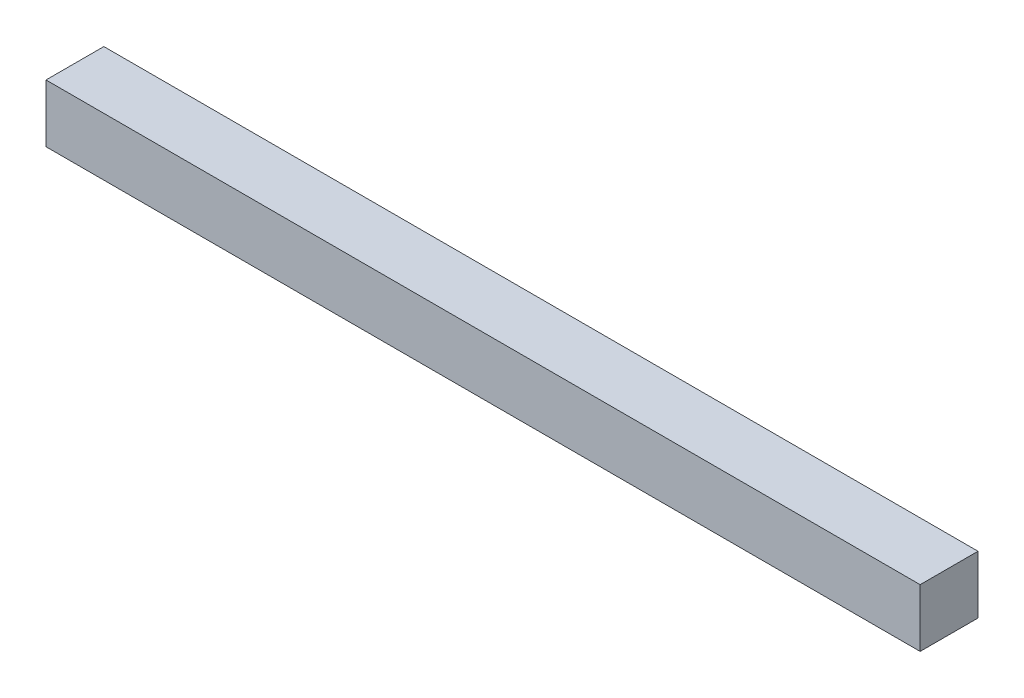
ISO-10303-21;
HEADER;
FILE_DESCRIPTION(('STEP AP214'),'2;1');
FILE_NAME('part.step','',(''),(''),'','','');
FILE_SCHEMA(('AUTOMOTIVE_DESIGN { 1 0 10303 214 1 1 1 1 }'));
ENDSEC;
DATA;
#1=APPLICATION_CONTEXT('core data for automotive mechanical design processes');
#2=APPLICATION_PROTOCOL_DEFINITION('international standard','automotive_design',2000,#1);
#3=PRODUCT_CONTEXT('',#1,'mechanical');
#4=PRODUCT('Part','Part','',(#3));
#5=PRODUCT_RELATED_PRODUCT_CATEGORY('part','',(#4));
#6=PRODUCT_DEFINITION_FORMATION('','',#4);
#7=PRODUCT_DEFINITION_CONTEXT('part definition',#1,'design');
#8=PRODUCT_DEFINITION('design','',#6,#7);
#9=PRODUCT_DEFINITION_SHAPE('','',#8);
#10=(LENGTH_UNIT() NAMED_UNIT(*) SI_UNIT(.MILLI.,.METRE.));
#11=(NAMED_UNIT(*) PLANE_ANGLE_UNIT() SI_UNIT($,.RADIAN.));
#12=(NAMED_UNIT(*) SI_UNIT($,.STERADIAN.) SOLID_ANGLE_UNIT());
#13=UNCERTAINTY_MEASURE_WITH_UNIT(LENGTH_MEASURE(1.E-05),#10,'distance_accuracy_value','');
#14=(GEOMETRIC_REPRESENTATION_CONTEXT(3) GLOBAL_UNCERTAINTY_ASSIGNED_CONTEXT((#13)) GLOBAL_UNIT_ASSIGNED_CONTEXT((#10,
#11,#12)) REPRESENTATION_CONTEXT('',''));
#15=CARTESIAN_POINT('',(0.,0.,0.));
#16=DIRECTION('',(0.,0.,1.));
#17=DIRECTION('',(1.,0.,0.));
#18=AXIS2_PLACEMENT_3D('',#15,#16,#17);
#19=CARTESIAN_POINT('',(-295.,373.,295.));
#20=DIRECTION('',(0.,-1.,0.));
#21=DIRECTION('',(1.,0.,0.));
#22=AXIS2_PLACEMENT_3D('',#19,#20,#21);
#23=PLANE('',#22);
#24=DIRECTION('',(1.,0.,0.));
#25=VECTOR('',#24,1.);
#26=CARTESIAN_POINT('',(0.,373.,340.));
#27=LINE('',#26,#25);
#28=CARTESIAN_POINT('',(-340.,373.,340.));
#29=VERTEX_POINT('',#28);
#30=CARTESIAN_POINT('',(340.,373.,340.));
#31=VERTEX_POINT('',#30);
#32=EDGE_CURVE('E55',#29,#31,#27,.T.);
#33=ORIENTED_EDGE('',*,*,#32,.F.);
#34=DIRECTION('',(0.,0.,1.));
#35=VECTOR('',#34,1.);
#36=CARTESIAN_POINT('',(-340.,373.,295.));
#37=LINE('',#36,#35);
#38=CARTESIAN_POINT('',(-340.,373.,295.));
#39=VERTEX_POINT('',#38);
#40=EDGE_CURVE('E67',#39,#29,#37,.T.);
#41=ORIENTED_EDGE('',*,*,#40,.F.);
#42=DIRECTION('',(1.,0.,0.));
#43=VECTOR('',#42,1.);
#44=CARTESIAN_POINT('',(0.,373.,295.));
#45=LINE('',#44,#43);
#46=CARTESIAN_POINT('',(340.,373.,295.));
#47=VERTEX_POINT('',#46);
#48=EDGE_CURVE('E20',#39,#47,#45,.T.);
#49=ORIENTED_EDGE('',*,*,#48,.T.);
#50=DIRECTION('',(0.,0.,-1.));
#51=VECTOR('',#50,1.);
#52=CARTESIAN_POINT('',(340.,373.,295.));
#53=LINE('',#52,#51);
#54=EDGE_CURVE('E80',#31,#47,#53,.T.);
#55=ORIENTED_EDGE('',*,*,#54,.F.);
#56=EDGE_LOOP('',(#33,#41,#49,#55));
#57=FACE_BOUND('',#56,.T.);
#58=ADVANCED_FACE('F17',(#57),#23,.T.);
#59=CARTESIAN_POINT('',(0.,395.5,295.));
#60=DIRECTION('',(0.,0.,1.));
#61=DIRECTION('',(1.,0.,0.));
#62=AXIS2_PLACEMENT_3D('',#59,#60,#61);
#63=PLANE('',#62);
#64=DIRECTION('',(0.,1.,0.));
#65=VECTOR('',#64,1.);
#66=CARTESIAN_POINT('',(340.,373.,295.));
#67=LINE('',#66,#65);
#68=CARTESIAN_POINT('',(340.,418.,295.));
#69=VERTEX_POINT('',#68);
#70=EDGE_CURVE('E65',#47,#69,#67,.T.);
#71=ORIENTED_EDGE('',*,*,#70,.F.);
#72=ORIENTED_EDGE('',*,*,#48,.F.);
#73=DIRECTION('',(0.,1.,0.));
#74=VECTOR('',#73,1.);
#75=CARTESIAN_POINT('',(-340.,418.,295.));
#76=LINE('',#75,#74);
#77=CARTESIAN_POINT('',(-340.,418.,295.));
#78=VERTEX_POINT('',#77);
#79=EDGE_CURVE('E62',#78,#39,#76,.F.);
#80=ORIENTED_EDGE('',*,*,#79,.F.);
#81=DIRECTION('',(1.,0.,0.));
#82=VECTOR('',#81,1.);
#83=CARTESIAN_POINT('',(295.,418.,295.));
#84=LINE('',#83,#82);
#85=EDGE_CURVE('E83',#69,#78,#84,.F.);
#86=ORIENTED_EDGE('',*,*,#85,.F.);
#87=EDGE_LOOP('',(#71,#72,#80,#86));
#88=FACE_BOUND('',#87,.T.);
#89=ADVANCED_FACE('F60',(#88),#63,.F.);
#90=CARTESIAN_POINT('',(-340.,418.,295.));
#91=DIRECTION('',(-1.,0.,0.));
#92=DIRECTION('',(0.,0.,1.));
#93=AXIS2_PLACEMENT_3D('',#90,#91,#92);
#94=PLANE('',#93);
#95=ORIENTED_EDGE('',*,*,#79,.T.);
#96=ORIENTED_EDGE('',*,*,#40,.T.);
#97=DIRECTION('',(0.,1.,0.));
#98=VECTOR('',#97,1.);
#99=CARTESIAN_POINT('',(-340.,395.5,340.));
#100=LINE('',#99,#98);
#101=CARTESIAN_POINT('',(-340.,418.,340.));
#102=VERTEX_POINT('',#101);
#103=EDGE_CURVE('E77',#102,#29,#100,.F.);
#104=ORIENTED_EDGE('',*,*,#103,.F.);
#105=DIRECTION('',(0.,0.,1.));
#106=VECTOR('',#105,1.);
#107=CARTESIAN_POINT('',(-340.,418.,295.));
#108=LINE('',#107,#106);
#109=EDGE_CURVE('E73',#78,#102,#108,.T.);
#110=ORIENTED_EDGE('',*,*,#109,.F.);
#111=EDGE_LOOP('',(#95,#96,#104,#110));
#112=FACE_BOUND('',#111,.T.);
#113=ADVANCED_FACE('F71',(#112),#94,.T.);
#114=CARTESIAN_POINT('',(0.,395.5,340.));
#115=DIRECTION('',(0.,0.,1.));
#116=DIRECTION('',(1.,0.,0.));
#117=AXIS2_PLACEMENT_3D('',#114,#115,#116);
#118=PLANE('',#117);
#119=DIRECTION('',(1.,0.,0.));
#120=VECTOR('',#119,1.);
#121=CARTESIAN_POINT('',(295.,418.,340.));
#122=LINE('',#121,#120);
#123=CARTESIAN_POINT('',(340.,418.,340.));
#124=VERTEX_POINT('',#123);
#125=EDGE_CURVE('E26',#102,#124,#122,.T.);
#126=ORIENTED_EDGE('',*,*,#125,.F.);
#127=ORIENTED_EDGE('',*,*,#103,.T.);
#128=ORIENTED_EDGE('',*,*,#32,.T.);
#129=DIRECTION('',(0.,1.,0.));
#130=VECTOR('',#129,1.);
#131=CARTESIAN_POINT('',(340.,373.,340.));
#132=LINE('',#131,#130);
#133=EDGE_CURVE('E35',#124,#31,#132,.F.);
#134=ORIENTED_EDGE('',*,*,#133,.F.);
#135=EDGE_LOOP('',(#126,#127,#128,#134));
#136=FACE_BOUND('',#135,.T.);
#137=ADVANCED_FACE('F89',(#136),#118,.T.);
#138=CARTESIAN_POINT('',(340.,373.,295.));
#139=DIRECTION('',(1.,0.,0.));
#140=DIRECTION('',(0.,0.,-1.));
#141=AXIS2_PLACEMENT_3D('',#138,#139,#140);
#142=PLANE('',#141);
#143=ORIENTED_EDGE('',*,*,#70,.T.);
#144=DIRECTION('',(0.,0.,1.));
#145=VECTOR('',#144,1.);
#146=CARTESIAN_POINT('',(340.,418.,295.));
#147=LINE('',#146,#145);
#148=EDGE_CURVE('E11',#124,#69,#147,.F.);
#149=ORIENTED_EDGE('',*,*,#148,.F.);
#150=ORIENTED_EDGE('',*,*,#133,.T.);
#151=ORIENTED_EDGE('',*,*,#54,.T.);
#152=EDGE_LOOP('',(#143,#149,#150,#151));
#153=FACE_BOUND('',#152,.T.);
#154=ADVANCED_FACE('F91',(#153),#142,.T.);
#155=CARTESIAN_POINT('',(295.,418.,295.));
#156=DIRECTION('',(0.,1.,0.));
#157=DIRECTION('',(0.,0.,1.));
#158=AXIS2_PLACEMENT_3D('',#155,#156,#157);
#159=PLANE('',#158);
#160=ORIENTED_EDGE('',*,*,#125,.T.);
#161=ORIENTED_EDGE('',*,*,#148,.T.);
#162=ORIENTED_EDGE('',*,*,#85,.T.);
#163=ORIENTED_EDGE('',*,*,#109,.T.);
#164=EDGE_LOOP('',(#160,#161,#162,#163));
#165=FACE_BOUND('',#164,.T.);
#166=ADVANCED_FACE('F88',(#165),#159,.T.);
#167=CLOSED_SHELL('',(#58,#89,#113,#137,#154,#166));
#168=MANIFOLD_SOLID_BREP('B1',#167);
#169=ADVANCED_BREP_SHAPE_REPRESENTATION('',(#18,#168),#14);
#170=SHAPE_DEFINITION_REPRESENTATION(#9,#169);
ENDSEC;
END-ISO-10303-21;
